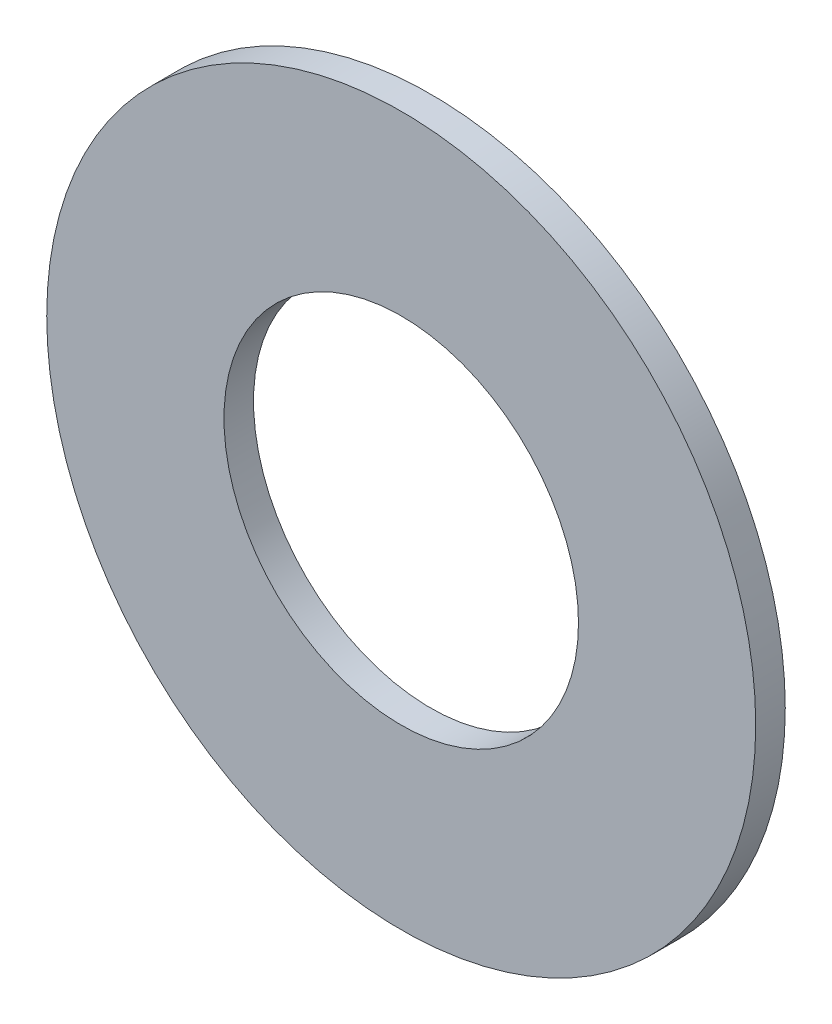
ISO-10303-21;
HEADER;
FILE_DESCRIPTION(('STEP AP214'),'2;1');
FILE_NAME('part.step','',(''),(''),'','','');
FILE_SCHEMA(('AUTOMOTIVE_DESIGN { 1 0 10303 214 1 1 1 1 }'));
ENDSEC;
DATA;
#1=APPLICATION_CONTEXT('core data for automotive mechanical design processes');
#2=APPLICATION_PROTOCOL_DEFINITION('international standard','automotive_design',2000,#1);
#3=PRODUCT_CONTEXT('',#1,'mechanical');
#4=PRODUCT('Part','Part','',(#3));
#5=PRODUCT_RELATED_PRODUCT_CATEGORY('part','',(#4));
#6=PRODUCT_DEFINITION_FORMATION('','',#4);
#7=PRODUCT_DEFINITION_CONTEXT('part definition',#1,'design');
#8=PRODUCT_DEFINITION('design','',#6,#7);
#9=PRODUCT_DEFINITION_SHAPE('','',#8);
#10=(LENGTH_UNIT() NAMED_UNIT(*) SI_UNIT(.MILLI.,.METRE.));
#11=(NAMED_UNIT(*) PLANE_ANGLE_UNIT() SI_UNIT($,.RADIAN.));
#12=(NAMED_UNIT(*) SI_UNIT($,.STERADIAN.) SOLID_ANGLE_UNIT());
#13=UNCERTAINTY_MEASURE_WITH_UNIT(LENGTH_MEASURE(1.E-05),#10,'distance_accuracy_value','');
#14=(GEOMETRIC_REPRESENTATION_CONTEXT(3) GLOBAL_UNCERTAINTY_ASSIGNED_CONTEXT((#13)) GLOBAL_UNIT_ASSIGNED_CONTEXT((#10,
#11,#12)) REPRESENTATION_CONTEXT('',''));
#15=CARTESIAN_POINT('',(0.,0.,0.));
#16=DIRECTION('',(0.,0.,1.));
#17=DIRECTION('',(1.,0.,0.));
#18=AXIS2_PLACEMENT_3D('',#15,#16,#17);
#19=CARTESIAN_POINT('',(0.,0.,0.79375));
#20=DIRECTION('',(0.,0.,1.));
#21=DIRECTION('',(1.,0.,0.));
#22=AXIS2_PLACEMENT_3D('',#19,#20,#21);
#23=PLANE('',#22);
#24=CARTESIAN_POINT('',(0.,0.,0.79375));
#25=DIRECTION('',(0.,0.,1.));
#26=DIRECTION('',(1.,0.,0.));
#27=AXIS2_PLACEMENT_3D('',#24,#25,#26);
#28=CIRCLE('',#27,9.525);
#29=CARTESIAN_POINT('',(9.525,0.,0.79375));
#30=VERTEX_POINT('',#29);
#31=EDGE_CURVE('E10',#30,#30,#28,.T.);
#32=ORIENTED_EDGE('',*,*,#31,.T.);
#33=EDGE_LOOP('',(#32));
#34=FACE_BOUND('',#33,.T.);
#35=CARTESIAN_POINT('',(0.,0.,0.79375));
#36=DIRECTION('',(0.,0.,1.));
#37=DIRECTION('',(1.,0.,0.));
#38=AXIS2_PLACEMENT_3D('',#35,#36,#37);
#39=CIRCLE('',#38,4.7625);
#40=CARTESIAN_POINT('',(4.7625,0.,0.79375));
#41=VERTEX_POINT('',#40);
#42=EDGE_CURVE('E42',#41,#41,#39,.T.);
#43=ORIENTED_EDGE('',*,*,#42,.F.);
#44=EDGE_LOOP('',(#43));
#45=FACE_BOUND('',#44,.T.);
#46=ADVANCED_FACE('F31',(#34,#45),#23,.T.);
#47=CARTESIAN_POINT('',(0.,0.,0.));
#48=DIRECTION('',(0.,0.,1.));
#49=DIRECTION('',(1.,0.,0.));
#50=AXIS2_PLACEMENT_3D('',#47,#48,#49);
#51=PLANE('',#50);
#52=CARTESIAN_POINT('',(0.,0.,0.));
#53=DIRECTION('',(0.,0.,1.));
#54=DIRECTION('',(1.,0.,0.));
#55=AXIS2_PLACEMENT_3D('',#52,#53,#54);
#56=CIRCLE('',#55,9.525);
#57=CARTESIAN_POINT('',(9.525,0.,0.));
#58=VERTEX_POINT('',#57);
#59=EDGE_CURVE('E35',#58,#58,#56,.T.);
#60=ORIENTED_EDGE('',*,*,#59,.F.);
#61=EDGE_LOOP('',(#60));
#62=FACE_BOUND('',#61,.T.);
#63=CARTESIAN_POINT('',(0.,0.,0.));
#64=DIRECTION('',(0.,0.,1.));
#65=DIRECTION('',(1.,0.,0.));
#66=AXIS2_PLACEMENT_3D('',#63,#64,#65);
#67=CIRCLE('',#66,4.7625);
#68=CARTESIAN_POINT('',(4.7625,0.,0.));
#69=VERTEX_POINT('',#68);
#70=EDGE_CURVE('E44',#69,#69,#67,.T.);
#71=ORIENTED_EDGE('',*,*,#70,.T.);
#72=EDGE_LOOP('',(#71));
#73=FACE_BOUND('',#72,.T.);
#74=ADVANCED_FACE('F54',(#62,#73),#51,.F.);
#75=CARTESIAN_POINT('',(0.,0.,0.79375));
#76=DIRECTION('',(0.,0.,-1.));
#77=DIRECTION('',(-1.,0.,0.));
#78=AXIS2_PLACEMENT_3D('',#75,#76,#77);
#79=CYLINDRICAL_SURFACE('',#78,9.525);
#80=ORIENTED_EDGE('',*,*,#31,.F.);
#81=EDGE_LOOP('',(#80));
#82=FACE_BOUND('',#81,.T.);
#83=ORIENTED_EDGE('',*,*,#59,.T.);
#84=EDGE_LOOP('',(#83));
#85=FACE_BOUND('',#84,.T.);
#86=ADVANCED_FACE('F33',(#82,#85),#79,.T.);
#87=CARTESIAN_POINT('',(0.,0.,0.79375));
#88=DIRECTION('',(0.,0.,-1.));
#89=DIRECTION('',(-1.,0.,0.));
#90=AXIS2_PLACEMENT_3D('',#87,#88,#89);
#91=CYLINDRICAL_SURFACE('',#90,4.7625);
#92=ORIENTED_EDGE('',*,*,#42,.T.);
#93=EDGE_LOOP('',(#92));
#94=FACE_BOUND('',#93,.T.);
#95=ORIENTED_EDGE('',*,*,#70,.F.);
#96=EDGE_LOOP('',(#95));
#97=FACE_BOUND('',#96,.T.);
#98=ADVANCED_FACE('F50',(#94,#97),#91,.F.);
#99=CLOSED_SHELL('',(#46,#74,#86,#98));
#100=MANIFOLD_SOLID_BREP('B2',#99);
#101=ADVANCED_BREP_SHAPE_REPRESENTATION('',(#18,#100),#14);
#102=SHAPE_DEFINITION_REPRESENTATION(#9,#101);
ENDSEC;
END-ISO-10303-21;
